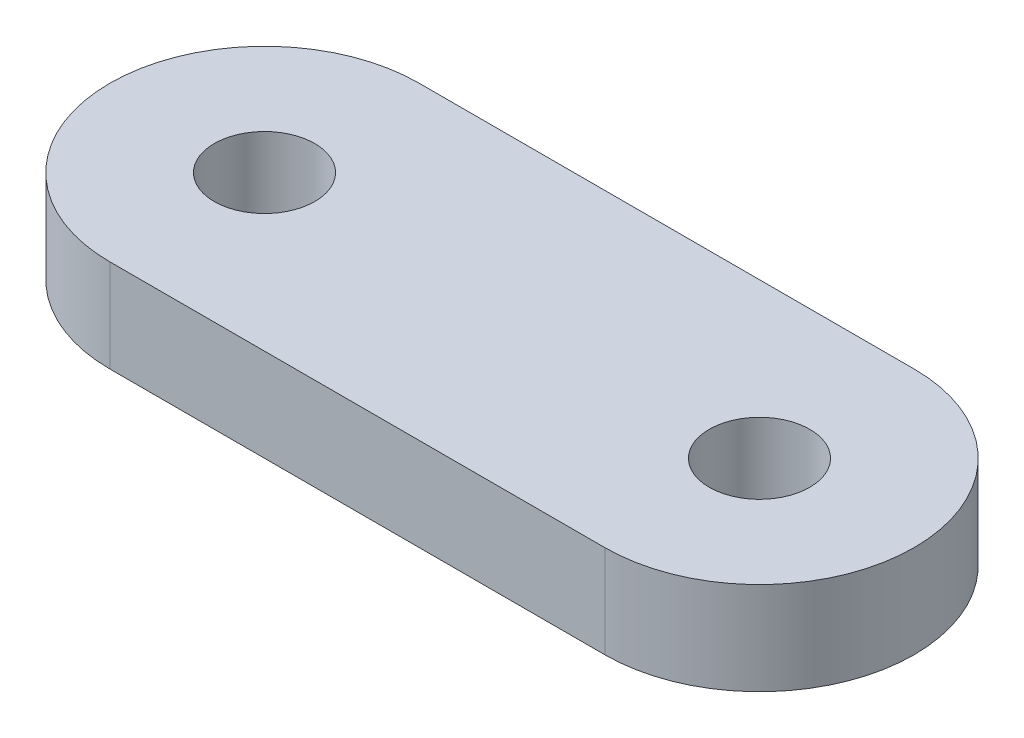
ISO-10303-21;
HEADER;
FILE_DESCRIPTION(('STEP AP214'),'2;1');
FILE_NAME('part.step','',(''),(''),'','','');
FILE_SCHEMA(('AUTOMOTIVE_DESIGN { 1 0 10303 214 1 1 1 1 }'));
ENDSEC;
DATA;
#1=APPLICATION_CONTEXT('core data for automotive mechanical design processes');
#2=APPLICATION_PROTOCOL_DEFINITION('international standard','automotive_design',2000,#1);
#3=PRODUCT_CONTEXT('',#1,'mechanical');
#4=PRODUCT('Part','Part','',(#3));
#5=PRODUCT_RELATED_PRODUCT_CATEGORY('part','',(#4));
#6=PRODUCT_DEFINITION_FORMATION('','',#4);
#7=PRODUCT_DEFINITION_CONTEXT('part definition',#1,'design');
#8=PRODUCT_DEFINITION('design','',#6,#7);
#9=PRODUCT_DEFINITION_SHAPE('','',#8);
#10=(LENGTH_UNIT() NAMED_UNIT(*) SI_UNIT(.MILLI.,.METRE.));
#11=(NAMED_UNIT(*) PLANE_ANGLE_UNIT() SI_UNIT($,.RADIAN.));
#12=(NAMED_UNIT(*) SI_UNIT($,.STERADIAN.) SOLID_ANGLE_UNIT());
#13=UNCERTAINTY_MEASURE_WITH_UNIT(LENGTH_MEASURE(1.E-05),#10,'distance_accuracy_value','');
#14=(GEOMETRIC_REPRESENTATION_CONTEXT(3) GLOBAL_UNCERTAINTY_ASSIGNED_CONTEXT((#13)) GLOBAL_UNIT_ASSIGNED_CONTEXT((#10,
#11,#12)) REPRESENTATION_CONTEXT('',''));
#15=CARTESIAN_POINT('',(0.,0.,0.));
#16=DIRECTION('',(0.,0.,1.));
#17=DIRECTION('',(1.,0.,0.));
#18=AXIS2_PLACEMENT_3D('',#15,#16,#17);
#19=CARTESIAN_POINT('',(0.,3.,0.));
#20=DIRECTION('',(0.,1.,0.));
#21=DIRECTION('',(0.,0.,1.));
#22=AXIS2_PLACEMENT_3D('',#19,#20,#21);
#23=PLANE('',#22);
#24=CARTESIAN_POINT('',(0.,3.,0.));
#25=DIRECTION('',(0.,1.,0.));
#26=DIRECTION('',(0.,0.,1.));
#27=AXIS2_PLACEMENT_3D('',#24,#25,#26);
#28=CIRCLE('',#27,1.625);
#29=CARTESIAN_POINT('',(0.,3.,1.625));
#30=VERTEX_POINT('',#29);
#31=EDGE_CURVE('E100',#30,#30,#28,.T.);
#32=ORIENTED_EDGE('',*,*,#31,.F.);
#33=EDGE_LOOP('',(#32));
#34=FACE_BOUND('',#33,.T.);
#35=CARTESIAN_POINT('',(0.,3.,0.));
#36=DIRECTION('',(0.,1.,0.));
#37=DIRECTION('',(0.,0.,1.));
#38=AXIS2_PLACEMENT_3D('',#35,#36,#37);
#39=CIRCLE('',#38,5.);
#40=CARTESIAN_POINT('',(0.,3.,-5.));
#41=VERTEX_POINT('',#40);
#42=CARTESIAN_POINT('',(0.,3.,5.));
#43=VERTEX_POINT('',#42);
#44=EDGE_CURVE('E85',#41,#43,#39,.T.);
#45=ORIENTED_EDGE('',*,*,#44,.T.);
#46=DIRECTION('',(1.,0.,0.));
#47=VECTOR('',#46,1.);
#48=CARTESIAN_POINT('',(0.,3.,5.));
#49=LINE('',#48,#47);
#50=CARTESIAN_POINT('',(16.,3.,5.));
#51=VERTEX_POINT('',#50);
#52=EDGE_CURVE('E80',#43,#51,#49,.T.);
#53=ORIENTED_EDGE('',*,*,#52,.T.);
#54=CARTESIAN_POINT('',(16.,3.,0.));
#55=DIRECTION('',(0.,1.,0.));
#56=DIRECTION('',(0.,0.,1.));
#57=AXIS2_PLACEMENT_3D('',#54,#55,#56);
#58=CIRCLE('',#57,5.);
#59=CARTESIAN_POINT('',(16.,3.,-5.));
#60=VERTEX_POINT('',#59);
#61=EDGE_CURVE('E83',#51,#60,#58,.T.);
#62=ORIENTED_EDGE('',*,*,#61,.T.);
#63=DIRECTION('',(-1.,0.,0.));
#64=VECTOR('',#63,1.);
#65=CARTESIAN_POINT('',(0.,3.,-5.));
#66=LINE('',#65,#64);
#67=EDGE_CURVE('E50',#60,#41,#66,.T.);
#68=ORIENTED_EDGE('',*,*,#67,.T.);
#69=EDGE_LOOP('',(#45,#53,#62,#68));
#70=FACE_BOUND('',#69,.T.);
#71=CARTESIAN_POINT('',(16.,3.,0.));
#72=DIRECTION('',(0.,1.,0.));
#73=DIRECTION('',(0.,0.,1.));
#74=AXIS2_PLACEMENT_3D('',#71,#72,#73);
#75=CIRCLE('',#74,1.625);
#76=CARTESIAN_POINT('',(16.,3.,1.625));
#77=VERTEX_POINT('',#76);
#78=EDGE_CURVE('E115',#77,#77,#75,.T.);
#79=ORIENTED_EDGE('',*,*,#78,.F.);
#80=EDGE_LOOP('',(#79));
#81=FACE_BOUND('',#80,.T.);
#82=ADVANCED_FACE('F33',(#34,#70,#81),#23,.T.);
#83=CARTESIAN_POINT('',(0.,0.,0.));
#84=DIRECTION('',(0.,1.,0.));
#85=DIRECTION('',(0.,0.,1.));
#86=AXIS2_PLACEMENT_3D('',#83,#84,#85);
#87=PLANE('',#86);
#88=CARTESIAN_POINT('',(0.,0.,0.));
#89=DIRECTION('',(0.,1.,0.));
#90=DIRECTION('',(0.,0.,1.));
#91=AXIS2_PLACEMENT_3D('',#88,#89,#90);
#92=CIRCLE('',#91,5.);
#93=CARTESIAN_POINT('',(0.,0.,-5.));
#94=VERTEX_POINT('',#93);
#95=CARTESIAN_POINT('',(0.,0.,5.));
#96=VERTEX_POINT('',#95);
#97=EDGE_CURVE('E97',#94,#96,#92,.T.);
#98=ORIENTED_EDGE('',*,*,#97,.F.);
#99=DIRECTION('',(-1.,0.,0.));
#100=VECTOR('',#99,1.);
#101=CARTESIAN_POINT('',(0.,0.,-5.));
#102=LINE('',#101,#100);
#103=CARTESIAN_POINT('',(16.,0.,-5.));
#104=VERTEX_POINT('',#103);
#105=EDGE_CURVE('E73',#104,#94,#102,.T.);
#106=ORIENTED_EDGE('',*,*,#105,.F.);
#107=CARTESIAN_POINT('',(16.,0.,0.));
#108=DIRECTION('',(0.,1.,0.));
#109=DIRECTION('',(0.,0.,1.));
#110=AXIS2_PLACEMENT_3D('',#107,#108,#109);
#111=CIRCLE('',#110,5.);
#112=CARTESIAN_POINT('',(16.,0.,5.));
#113=VERTEX_POINT('',#112);
#114=EDGE_CURVE('E67',#113,#104,#111,.T.);
#115=ORIENTED_EDGE('',*,*,#114,.F.);
#116=DIRECTION('',(1.,0.,0.));
#117=VECTOR('',#116,1.);
#118=CARTESIAN_POINT('',(0.,0.,5.));
#119=LINE('',#118,#117);
#120=EDGE_CURVE('E89',#96,#113,#119,.T.);
#121=ORIENTED_EDGE('',*,*,#120,.F.);
#122=EDGE_LOOP('',(#98,#106,#115,#121));
#123=FACE_BOUND('',#122,.T.);
#124=CARTESIAN_POINT('',(0.,0.,0.));
#125=DIRECTION('',(0.,1.,0.));
#126=DIRECTION('',(0.,0.,1.));
#127=AXIS2_PLACEMENT_3D('',#124,#125,#126);
#128=CIRCLE('',#127,1.625);
#129=CARTESIAN_POINT('',(0.,0.,1.625));
#130=VERTEX_POINT('',#129);
#131=EDGE_CURVE('E112',#130,#130,#128,.T.);
#132=ORIENTED_EDGE('',*,*,#131,.T.);
#133=EDGE_LOOP('',(#132));
#134=FACE_BOUND('',#133,.T.);
#135=CARTESIAN_POINT('',(16.,0.,0.));
#136=DIRECTION('',(0.,1.,0.));
#137=DIRECTION('',(0.,0.,1.));
#138=AXIS2_PLACEMENT_3D('',#135,#136,#137);
#139=CIRCLE('',#138,1.625);
#140=CARTESIAN_POINT('',(16.,0.,1.625));
#141=VERTEX_POINT('',#140);
#142=EDGE_CURVE('E118',#141,#141,#139,.T.);
#143=ORIENTED_EDGE('',*,*,#142,.T.);
#144=EDGE_LOOP('',(#143));
#145=FACE_BOUND('',#144,.T.);
#146=ADVANCED_FACE('F108',(#123,#134,#145),#87,.F.);
#147=CARTESIAN_POINT('',(0.,3.,0.));
#148=DIRECTION('',(0.,-1.,0.));
#149=DIRECTION('',(0.,0.,-1.));
#150=AXIS2_PLACEMENT_3D('',#147,#148,#149);
#151=CYLINDRICAL_SURFACE('',#150,5.);
#152=ORIENTED_EDGE('',*,*,#97,.T.);
#153=DIRECTION('',(0.,-1.,0.));
#154=VECTOR('',#153,1.);
#155=CARTESIAN_POINT('',(0.,3.,5.));
#156=LINE('',#155,#154);
#157=EDGE_CURVE('E11',#43,#96,#156,.T.);
#158=ORIENTED_EDGE('',*,*,#157,.F.);
#159=ORIENTED_EDGE('',*,*,#44,.F.);
#160=DIRECTION('',(0.,-1.,0.));
#161=VECTOR('',#160,1.);
#162=CARTESIAN_POINT('',(0.,3.,-5.));
#163=LINE('',#162,#161);
#164=EDGE_CURVE('E93',#41,#94,#163,.T.);
#165=ORIENTED_EDGE('',*,*,#164,.T.);
#166=EDGE_LOOP('',(#152,#158,#159,#165));
#167=FACE_BOUND('',#166,.T.);
#168=ADVANCED_FACE('F35',(#167),#151,.T.);
#169=CARTESIAN_POINT('',(0.,3.,5.));
#170=DIRECTION('',(0.,0.,-1.));
#171=DIRECTION('',(-1.,0.,0.));
#172=AXIS2_PLACEMENT_3D('',#169,#170,#171);
#173=PLANE('',#172);
#174=ORIENTED_EDGE('',*,*,#120,.T.);
#175=DIRECTION('',(0.,-1.,0.));
#176=VECTOR('',#175,1.);
#177=CARTESIAN_POINT('',(16.,3.,5.));
#178=LINE('',#177,#176);
#179=EDGE_CURVE('E42',#51,#113,#178,.T.);
#180=ORIENTED_EDGE('',*,*,#179,.F.);
#181=ORIENTED_EDGE('',*,*,#52,.F.);
#182=ORIENTED_EDGE('',*,*,#157,.T.);
#183=EDGE_LOOP('',(#174,#180,#181,#182));
#184=FACE_BOUND('',#183,.T.);
#185=ADVANCED_FACE('F88',(#184),#173,.F.);
#186=CARTESIAN_POINT('',(16.,3.,0.));
#187=DIRECTION('',(0.,-1.,0.));
#188=DIRECTION('',(0.,0.,-1.));
#189=AXIS2_PLACEMENT_3D('',#186,#187,#188);
#190=CYLINDRICAL_SURFACE('',#189,5.);
#191=ORIENTED_EDGE('',*,*,#114,.T.);
#192=DIRECTION('',(0.,-1.,0.));
#193=VECTOR('',#192,1.);
#194=CARTESIAN_POINT('',(16.,3.,-5.));
#195=LINE('',#194,#193);
#196=EDGE_CURVE('E90',#60,#104,#195,.T.);
#197=ORIENTED_EDGE('',*,*,#196,.F.);
#198=ORIENTED_EDGE('',*,*,#61,.F.);
#199=ORIENTED_EDGE('',*,*,#179,.T.);
#200=EDGE_LOOP('',(#191,#197,#198,#199));
#201=FACE_BOUND('',#200,.T.);
#202=ADVANCED_FACE('F91',(#201),#190,.T.);
#203=CARTESIAN_POINT('',(0.,3.,-5.));
#204=DIRECTION('',(0.,0.,1.));
#205=DIRECTION('',(1.,0.,0.));
#206=AXIS2_PLACEMENT_3D('',#203,#204,#205);
#207=PLANE('',#206);
#208=ORIENTED_EDGE('',*,*,#105,.T.);
#209=ORIENTED_EDGE('',*,*,#164,.F.);
#210=ORIENTED_EDGE('',*,*,#67,.F.);
#211=ORIENTED_EDGE('',*,*,#196,.T.);
#212=EDGE_LOOP('',(#208,#209,#210,#211));
#213=FACE_BOUND('',#212,.T.);
#214=ADVANCED_FACE('F105',(#213),#207,.F.);
#215=CARTESIAN_POINT('',(0.,3.,0.));
#216=DIRECTION('',(0.,-1.,0.));
#217=DIRECTION('',(0.,0.,-1.));
#218=AXIS2_PLACEMENT_3D('',#215,#216,#217);
#219=CYLINDRICAL_SURFACE('',#218,1.625);
#220=ORIENTED_EDGE('',*,*,#31,.T.);
#221=EDGE_LOOP('',(#220));
#222=FACE_BOUND('',#221,.T.);
#223=ORIENTED_EDGE('',*,*,#131,.F.);
#224=EDGE_LOOP('',(#223));
#225=FACE_BOUND('',#224,.T.);
#226=ADVANCED_FACE('F135',(#222,#225),#219,.F.);
#227=CARTESIAN_POINT('',(16.,3.,0.));
#228=DIRECTION('',(0.,-1.,0.));
#229=DIRECTION('',(0.,0.,-1.));
#230=AXIS2_PLACEMENT_3D('',#227,#228,#229);
#231=CYLINDRICAL_SURFACE('',#230,1.625);
#232=ORIENTED_EDGE('',*,*,#78,.T.);
#233=EDGE_LOOP('',(#232));
#234=FACE_BOUND('',#233,.T.);
#235=ORIENTED_EDGE('',*,*,#142,.F.);
#236=EDGE_LOOP('',(#235));
#237=FACE_BOUND('',#236,.T.);
#238=ADVANCED_FACE('F124',(#234,#237),#231,.F.);
#239=CLOSED_SHELL('',(#82,#146,#168,#185,#202,#214,#226,#238));
#240=MANIFOLD_SOLID_BREP('B2',#239);
#241=ADVANCED_BREP_SHAPE_REPRESENTATION('',(#18,#240),#14);
#242=SHAPE_DEFINITION_REPRESENTATION(#9,#241);
ENDSEC;
END-ISO-10303-21;
